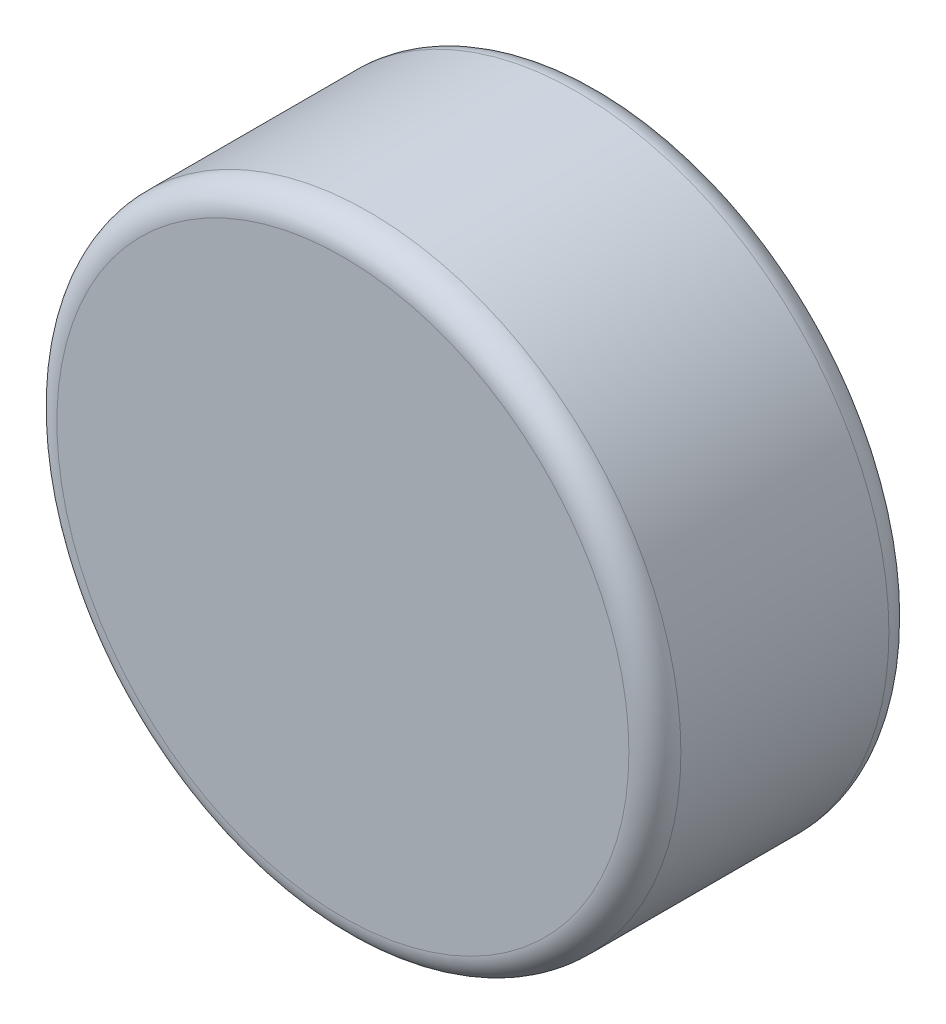
ISO-10303-21;
HEADER;
FILE_DESCRIPTION(('STEP AP214'),'2;1');
FILE_NAME('part.step','',(''),(''),'','','');
FILE_SCHEMA(('AUTOMOTIVE_DESIGN { 1 0 10303 214 1 1 1 1 }'));
ENDSEC;
DATA;
#1=APPLICATION_CONTEXT('core data for automotive mechanical design processes');
#2=APPLICATION_PROTOCOL_DEFINITION('international standard','automotive_design',2000,#1);
#3=PRODUCT_CONTEXT('',#1,'mechanical');
#4=PRODUCT('Part','Part','',(#3));
#5=PRODUCT_RELATED_PRODUCT_CATEGORY('part','',(#4));
#6=PRODUCT_DEFINITION_FORMATION('','',#4);
#7=PRODUCT_DEFINITION_CONTEXT('part definition',#1,'design');
#8=PRODUCT_DEFINITION('design','',#6,#7);
#9=PRODUCT_DEFINITION_SHAPE('','',#8);
#10=(LENGTH_UNIT() NAMED_UNIT(*) SI_UNIT(.MILLI.,.METRE.));
#11=(NAMED_UNIT(*) PLANE_ANGLE_UNIT() SI_UNIT($,.RADIAN.));
#12=(NAMED_UNIT(*) SI_UNIT($,.STERADIAN.) SOLID_ANGLE_UNIT());
#13=UNCERTAINTY_MEASURE_WITH_UNIT(LENGTH_MEASURE(1.E-05),#10,'distance_accuracy_value','');
#14=(GEOMETRIC_REPRESENTATION_CONTEXT(3) GLOBAL_UNCERTAINTY_ASSIGNED_CONTEXT((#13)) GLOBAL_UNIT_ASSIGNED_CONTEXT((#10,
#11,#12)) REPRESENTATION_CONTEXT('',''));
#15=CARTESIAN_POINT('',(0.,0.,0.));
#16=DIRECTION('',(0.,0.,1.));
#17=DIRECTION('',(1.,0.,0.));
#18=AXIS2_PLACEMENT_3D('',#15,#16,#17);
#19=CARTESIAN_POINT('',(0.,0.,2.5));
#20=DIRECTION('',(0.,0.,-1.));
#21=DIRECTION('',(-1.,0.,0.));
#22=AXIS2_PLACEMENT_3D('',#19,#20,#21);
#23=CYLINDRICAL_SURFACE('',#22,3.);
#24=CARTESIAN_POINT('',(0.,0.,0.25));
#25=DIRECTION('',(0.,0.,1.));
#26=DIRECTION('',(1.,0.,0.));
#27=AXIS2_PLACEMENT_3D('',#24,#25,#26);
#28=CIRCLE('',#27,3.);
#29=CARTESIAN_POINT('',(3.,0.,0.25));
#30=VERTEX_POINT('',#29);
#31=EDGE_CURVE('E41',#30,#30,#28,.T.);
#32=ORIENTED_EDGE('',*,*,#31,.T.);
#33=EDGE_LOOP('',(#32));
#34=FACE_BOUND('',#33,.T.);
#35=CARTESIAN_POINT('',(0.,0.,2.25));
#36=DIRECTION('',(0.,0.,1.));
#37=DIRECTION('',(1.,0.,0.));
#38=AXIS2_PLACEMENT_3D('',#35,#36,#37);
#39=CIRCLE('',#38,3.);
#40=CARTESIAN_POINT('',(3.,0.,2.25));
#41=VERTEX_POINT('',#40);
#42=EDGE_CURVE('E45',#41,#41,#39,.F.);
#43=ORIENTED_EDGE('',*,*,#42,.T.);
#44=EDGE_LOOP('',(#43));
#45=FACE_BOUND('',#44,.T.);
#46=ADVANCED_FACE('F30',(#34,#45),#23,.T.);
#47=CARTESIAN_POINT('',(0.,0.,2.5));
#48=DIRECTION('',(0.,0.,1.));
#49=DIRECTION('',(1.,0.,0.));
#50=AXIS2_PLACEMENT_3D('',#47,#48,#49);
#51=PLANE('',#50);
#52=CARTESIAN_POINT('',(0.,0.,2.5));
#53=DIRECTION('',(0.,0.,1.));
#54=DIRECTION('',(1.,0.,0.));
#55=AXIS2_PLACEMENT_3D('',#52,#53,#54);
#56=CIRCLE('',#55,2.75);
#57=CARTESIAN_POINT('',(2.75,0.,2.5));
#58=VERTEX_POINT('',#57);
#59=EDGE_CURVE('E10',#58,#58,#56,.T.);
#60=ORIENTED_EDGE('',*,*,#59,.T.);
#61=EDGE_LOOP('',(#60));
#62=FACE_BOUND('',#61,.T.);
#63=ADVANCED_FACE('F61',(#62),#51,.T.);
#64=CARTESIAN_POINT('',(0.,0.,0.));
#65=DIRECTION('',(0.,0.,1.));
#66=DIRECTION('',(1.,0.,0.));
#67=AXIS2_PLACEMENT_3D('',#64,#65,#66);
#68=PLANE('',#67);
#69=CARTESIAN_POINT('',(0.,0.,0.));
#70=DIRECTION('',(0.,0.,1.));
#71=DIRECTION('',(1.,0.,0.));
#72=AXIS2_PLACEMENT_3D('',#69,#70,#71);
#73=CIRCLE('',#72,2.75);
#74=CARTESIAN_POINT('',(2.75,0.,0.));
#75=VERTEX_POINT('',#74);
#76=EDGE_CURVE('E37',#75,#75,#73,.F.);
#77=ORIENTED_EDGE('',*,*,#76,.T.);
#78=EDGE_LOOP('',(#77));
#79=FACE_BOUND('',#78,.T.);
#80=ADVANCED_FACE('F58',(#79),#68,.F.);
#81=CARTESIAN_POINT('',(0.,0.,0.25));
#82=DIRECTION('',(0.,0.,1.));
#83=DIRECTION('',(1.,0.,0.));
#84=AXIS2_PLACEMENT_3D('',#81,#82,#83);
#85=TOROIDAL_SURFACE('',#84,2.75,0.25);
#86=ORIENTED_EDGE('',*,*,#76,.F.);
#87=EDGE_LOOP('',(#86));
#88=FACE_BOUND('',#87,.T.);
#89=ORIENTED_EDGE('',*,*,#31,.F.);
#90=EDGE_LOOP('',(#89));
#91=FACE_BOUND('',#90,.T.);
#92=ADVANCED_FACE('F54',(#88,#91),#85,.T.);
#93=CARTESIAN_POINT('',(0.,0.,2.25));
#94=DIRECTION('',(0.,0.,1.));
#95=DIRECTION('',(1.,0.,0.));
#96=AXIS2_PLACEMENT_3D('',#93,#94,#95);
#97=TOROIDAL_SURFACE('',#96,2.75,0.25);
#98=ORIENTED_EDGE('',*,*,#42,.F.);
#99=EDGE_LOOP('',(#98));
#100=FACE_BOUND('',#99,.T.);
#101=ORIENTED_EDGE('',*,*,#59,.F.);
#102=EDGE_LOOP('',(#101));
#103=FACE_BOUND('',#102,.T.);
#104=ADVANCED_FACE('F32',(#100,#103),#97,.T.);
#105=CLOSED_SHELL('',(#46,#63,#80,#92,#104));
#106=MANIFOLD_SOLID_BREP('B2',#105);
#107=ADVANCED_BREP_SHAPE_REPRESENTATION('',(#18,#106),#14);
#108=SHAPE_DEFINITION_REPRESENTATION(#9,#107);
ENDSEC;
END-ISO-10303-21;
